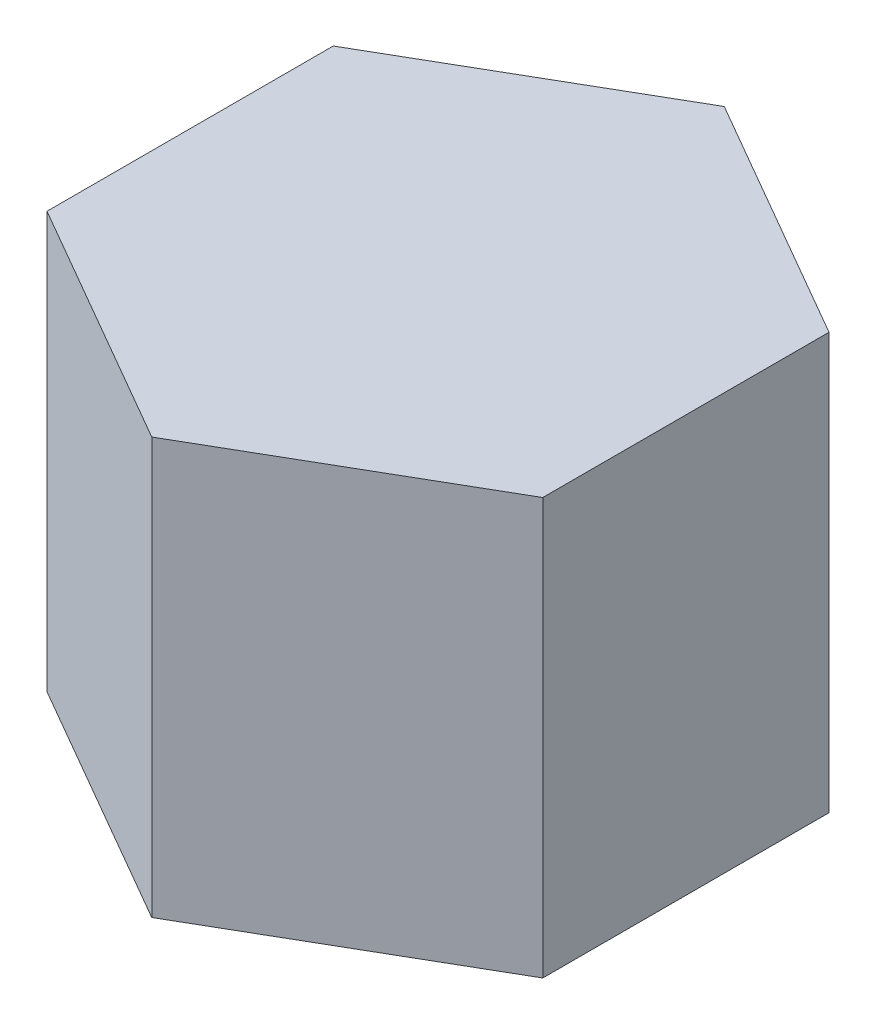
ISO-10303-21;
HEADER;
FILE_DESCRIPTION(('STEP AP214'),'2;1');
FILE_NAME('part.step','',(''),(''),'','','');
FILE_SCHEMA(('AUTOMOTIVE_DESIGN { 1 0 10303 214 1 1 1 1 }'));
ENDSEC;
DATA;
#1=APPLICATION_CONTEXT('core data for automotive mechanical design processes');
#2=APPLICATION_PROTOCOL_DEFINITION('international standard','automotive_design',2000,#1);
#3=PRODUCT_CONTEXT('',#1,'mechanical');
#4=PRODUCT('Part','Part','',(#3));
#5=PRODUCT_RELATED_PRODUCT_CATEGORY('part','',(#4));
#6=PRODUCT_DEFINITION_FORMATION('','',#4);
#7=PRODUCT_DEFINITION_CONTEXT('part definition',#1,'design');
#8=PRODUCT_DEFINITION('design','',#6,#7);
#9=PRODUCT_DEFINITION_SHAPE('','',#8);
#10=(LENGTH_UNIT() NAMED_UNIT(*) SI_UNIT(.MILLI.,.METRE.));
#11=(NAMED_UNIT(*) PLANE_ANGLE_UNIT() SI_UNIT($,.RADIAN.));
#12=(NAMED_UNIT(*) SI_UNIT($,.STERADIAN.) SOLID_ANGLE_UNIT());
#13=UNCERTAINTY_MEASURE_WITH_UNIT(LENGTH_MEASURE(1.E-05),#10,'distance_accuracy_value','');
#14=(GEOMETRIC_REPRESENTATION_CONTEXT(3) GLOBAL_UNCERTAINTY_ASSIGNED_CONTEXT((#13)) GLOBAL_UNIT_ASSIGNED_CONTEXT((#10,
#11,#12)) REPRESENTATION_CONTEXT('',''));
#15=CARTESIAN_POINT('',(0.,0.,0.));
#16=DIRECTION('',(0.,0.,1.));
#17=DIRECTION('',(1.,0.,0.));
#18=AXIS2_PLACEMENT_3D('',#15,#16,#17);
#19=CARTESIAN_POINT('',(209.339551417382,-147.556598747966,289.949920412926));
#20=DIRECTION('',(-0.499999999999978,0.,-0.866025403784452));
#21=DIRECTION('',(-0.866025403784452,0.,0.499999999999978));
#22=AXIS2_PLACEMENT_3D('',#19,#20,#21);
#23=PLANE('',#22);
#24=CARTESIAN_POINT('',(209.642660308706,-147.047793579175,289.774920412926));
#25=DIRECTION('',(-0.866025403784452,0.,0.499999999999978));
#26=VECTOR('',#25,1.);
#27=LINE('',#24,#26);
#28=CARTESIAN_POINT('',(209.642660308706,-147.047793579175,289.774920412926));
#29=VERTEX_POINT('',#28);
#30=CARTESIAN_POINT('',(209.339551417382,-147.047793579175,289.949920412926));
#31=VERTEX_POINT('',#30);
#32=EDGE_CURVE('E170',#29,#31,#27,.T.);
#33=ORIENTED_EDGE('',*,*,#32,.T.);
#34=CARTESIAN_POINT('',(209.339551417382,-147.556598747966,289.949920412926));
#35=DIRECTION('',(0.,1.,0.));
#36=VECTOR('',#35,1.);
#37=LINE('',#34,#36);
#38=CARTESIAN_POINT('',(209.339551417382,-147.556598747966,289.949920412926));
#39=VERTEX_POINT('',#38);
#40=EDGE_CURVE('E35',#39,#31,#37,.T.);
#41=ORIENTED_EDGE('',*,*,#40,.F.);
#42=CARTESIAN_POINT('',(209.642660308706,-147.556598747966,289.774920412926));
#43=DIRECTION('',(-0.866025403784452,0.,0.499999999999978));
#44=VECTOR('',#43,1.);
#45=LINE('',#42,#44);
#46=CARTESIAN_POINT('',(209.642660308706,-147.556598747966,289.774920412926));
#47=VERTEX_POINT('',#46);
#48=EDGE_CURVE('E159',#47,#39,#45,.T.);
#49=ORIENTED_EDGE('',*,*,#48,.F.);
#50=CARTESIAN_POINT('',(209.642660308706,-147.556598747966,289.774920412926));
#51=DIRECTION('',(0.,1.,0.));
#52=VECTOR('',#51,1.);
#53=LINE('',#50,#52);
#54=EDGE_CURVE('E10',#47,#29,#53,.T.);
#55=ORIENTED_EDGE('',*,*,#54,.T.);
#56=EDGE_LOOP('',(#33,#41,#49,#55));
#57=FACE_BOUND('',#56,.T.);
#58=ADVANCED_FACE('F16',(#57),#23,.F.);
#59=CARTESIAN_POINT('',(209.642660308706,-147.556598747966,291.594471220494));
#60=DIRECTION('',(-1.,0.,0.));
#61=DIRECTION('',(0.,-1.,0.));
#62=AXIS2_PLACEMENT_3D('',#59,#60,#61);
#63=PLANE('',#62);
#64=CARTESIAN_POINT('',(209.642660308706,-147.047793579175,289.424920412926));
#65=DIRECTION('',(0.,0.,1.));
#66=VECTOR('',#65,1.);
#67=LINE('',#64,#66);
#68=CARTESIAN_POINT('',(209.642660308706,-147.047793579175,289.424920412926));
#69=VERTEX_POINT('',#68);
#70=EDGE_CURVE('E167',#69,#29,#67,.T.);
#71=ORIENTED_EDGE('',*,*,#70,.T.);
#72=ORIENTED_EDGE('',*,*,#54,.F.);
#73=CARTESIAN_POINT('',(209.642660308706,-147.556598747966,289.424920412926));
#74=DIRECTION('',(0.,0.,1.));
#75=VECTOR('',#74,1.);
#76=LINE('',#73,#75);
#77=CARTESIAN_POINT('',(209.642660308706,-147.556598747966,289.424920412926));
#78=VERTEX_POINT('',#77);
#79=EDGE_CURVE('E156',#78,#47,#76,.T.);
#80=ORIENTED_EDGE('',*,*,#79,.F.);
#81=CARTESIAN_POINT('',(209.642660308706,-147.556598747966,289.424920412926));
#82=DIRECTION('',(0.,1.,0.));
#83=VECTOR('',#82,1.);
#84=LINE('',#81,#83);
#85=EDGE_CURVE('E27',#78,#69,#84,.T.);
#86=ORIENTED_EDGE('',*,*,#85,.T.);
#87=EDGE_LOOP('',(#71,#72,#80,#86));
#88=FACE_BOUND('',#87,.T.);
#89=ADVANCED_FACE('F189',(#88),#63,.F.);
#90=CARTESIAN_POINT('',(209.642660308706,-147.556598747966,289.424920412926));
#91=DIRECTION('',(-0.499999999999943,0.,0.866025403784471));
#92=DIRECTION('',(0.866025403784471,0.,0.499999999999943));
#93=AXIS2_PLACEMENT_3D('',#90,#91,#92);
#94=PLANE('',#93);
#95=CARTESIAN_POINT('',(209.339551417382,-147.047793579175,289.249920412926));
#96=DIRECTION('',(0.866025403784471,0.,0.499999999999943));
#97=VECTOR('',#96,1.);
#98=LINE('',#95,#97);
#99=CARTESIAN_POINT('',(209.339551417382,-147.047793579175,289.249920412926));
#100=VERTEX_POINT('',#99);
#101=EDGE_CURVE('E163',#100,#69,#98,.T.);
#102=ORIENTED_EDGE('',*,*,#101,.T.);
#103=ORIENTED_EDGE('',*,*,#85,.F.);
#104=CARTESIAN_POINT('',(209.339551417382,-147.556598747966,289.249920412926));
#105=DIRECTION('',(0.866025403784471,0.,0.499999999999943));
#106=VECTOR('',#105,1.);
#107=LINE('',#104,#106);
#108=CARTESIAN_POINT('',(209.339551417382,-147.556598747966,289.249920412926));
#109=VERTEX_POINT('',#108);
#110=EDGE_CURVE('E106',#109,#78,#107,.T.);
#111=ORIENTED_EDGE('',*,*,#110,.F.);
#112=CARTESIAN_POINT('',(209.339551417382,-147.556598747966,289.249920412926));
#113=DIRECTION('',(0.,1.,0.));
#114=VECTOR('',#113,1.);
#115=LINE('',#112,#114);
#116=EDGE_CURVE('E94',#109,#100,#115,.T.);
#117=ORIENTED_EDGE('',*,*,#116,.T.);
#118=EDGE_LOOP('',(#102,#103,#111,#117));
#119=FACE_BOUND('',#118,.T.);
#120=ADVANCED_FACE('F198',(#119),#94,.F.);
#121=CARTESIAN_POINT('',(209.339551417382,-147.556598747966,289.249920412926));
#122=DIRECTION('',(0.499999999999978,0.,0.866025403784452));
#123=DIRECTION('',(0.866025403784452,0.,-0.499999999999978));
#124=AXIS2_PLACEMENT_3D('',#121,#122,#123);
#125=PLANE('',#124);
#126=CARTESIAN_POINT('',(209.036442526057,-147.047793579175,289.424920412926));
#127=DIRECTION('',(0.866025403784452,0.,-0.499999999999978));
#128=VECTOR('',#127,1.);
#129=LINE('',#126,#128);
#130=CARTESIAN_POINT('',(209.036442526057,-147.047793579175,289.424920412926));
#131=VERTEX_POINT('',#130);
#132=EDGE_CURVE('E162',#131,#100,#129,.T.);
#133=ORIENTED_EDGE('',*,*,#132,.T.);
#134=ORIENTED_EDGE('',*,*,#116,.F.);
#135=CARTESIAN_POINT('',(209.036442526057,-147.556598747966,289.424920412926));
#136=DIRECTION('',(0.866025403784452,0.,-0.499999999999978));
#137=VECTOR('',#136,1.);
#138=LINE('',#135,#137);
#139=CARTESIAN_POINT('',(209.036442526057,-147.556598747966,289.424920412926));
#140=VERTEX_POINT('',#139);
#141=EDGE_CURVE('E98',#140,#109,#138,.T.);
#142=ORIENTED_EDGE('',*,*,#141,.F.);
#143=CARTESIAN_POINT('',(209.036442526057,-147.556598747966,289.424920412926));
#144=DIRECTION('',(0.,1.,0.));
#145=VECTOR('',#144,1.);
#146=LINE('',#143,#145);
#147=EDGE_CURVE('E79',#140,#131,#146,.T.);
#148=ORIENTED_EDGE('',*,*,#147,.T.);
#149=EDGE_LOOP('',(#133,#134,#142,#148));
#150=FACE_BOUND('',#149,.T.);
#151=ADVANCED_FACE('F100',(#150),#125,.F.);
#152=CARTESIAN_POINT('',(209.036442526057,-147.556598747966,291.594471220494));
#153=DIRECTION('',(1.,0.,0.));
#154=DIRECTION('',(0.,1.,0.));
#155=AXIS2_PLACEMENT_3D('',#152,#153,#154);
#156=PLANE('',#155);
#157=CARTESIAN_POINT('',(209.036442526057,-147.047793579175,289.774920412926));
#158=DIRECTION('',(0.,0.,-1.));
#159=VECTOR('',#158,1.);
#160=LINE('',#157,#159);
#161=CARTESIAN_POINT('',(209.036442526057,-147.047793579175,289.774920412926));
#162=VERTEX_POINT('',#161);
#163=EDGE_CURVE('E88',#162,#131,#160,.T.);
#164=ORIENTED_EDGE('',*,*,#163,.T.);
#165=ORIENTED_EDGE('',*,*,#147,.F.);
#166=CARTESIAN_POINT('',(209.036442526057,-147.556598747966,289.774920412926));
#167=DIRECTION('',(0.,0.,-1.));
#168=VECTOR('',#167,1.);
#169=LINE('',#166,#168);
#170=CARTESIAN_POINT('',(209.036442526057,-147.556598747966,289.774920412926));
#171=VERTEX_POINT('',#170);
#172=EDGE_CURVE('E84',#171,#140,#169,.T.);
#173=ORIENTED_EDGE('',*,*,#172,.F.);
#174=CARTESIAN_POINT('',(209.036442526057,-147.556598747966,289.774920412926));
#175=DIRECTION('',(0.,1.,0.));
#176=VECTOR('',#175,1.);
#177=LINE('',#174,#176);
#178=EDGE_CURVE('E58',#171,#162,#177,.T.);
#179=ORIENTED_EDGE('',*,*,#178,.T.);
#180=EDGE_LOOP('',(#164,#165,#173,#179));
#181=FACE_BOUND('',#180,.T.);
#182=ADVANCED_FACE('F82',(#181),#156,.F.);
#183=CARTESIAN_POINT('',(209.036442526057,-147.556598747966,289.774920412926));
#184=DIRECTION('',(0.499999999999943,0.,-0.866025403784471));
#185=DIRECTION('',(-0.866025403784471,0.,-0.499999999999943));
#186=AXIS2_PLACEMENT_3D('',#183,#184,#185);
#187=PLANE('',#186);
#188=CARTESIAN_POINT('',(209.339551417382,-147.047793579175,289.949920412926));
#189=DIRECTION('',(-0.866025403784471,0.,-0.499999999999943));
#190=VECTOR('',#189,1.);
#191=LINE('',#188,#190);
#192=EDGE_CURVE('E160',#31,#162,#191,.T.);
#193=ORIENTED_EDGE('',*,*,#192,.T.);
#194=ORIENTED_EDGE('',*,*,#178,.F.);
#195=CARTESIAN_POINT('',(209.339551417382,-147.556598747966,289.949920412926));
#196=DIRECTION('',(-0.866025403784471,0.,-0.499999999999943));
#197=VECTOR('',#196,1.);
#198=LINE('',#195,#197);
#199=EDGE_CURVE('E112',#39,#171,#198,.T.);
#200=ORIENTED_EDGE('',*,*,#199,.F.);
#201=ORIENTED_EDGE('',*,*,#40,.T.);
#202=EDGE_LOOP('',(#193,#194,#200,#201));
#203=FACE_BOUND('',#202,.T.);
#204=ADVANCED_FACE('F131',(#203),#187,.F.);
#205=CARTESIAN_POINT('',(206.491105863044,-147.556598747966,291.594471220494));
#206=DIRECTION('',(0.,1.,0.));
#207=DIRECTION('',(-1.,0.,0.));
#208=AXIS2_PLACEMENT_3D('',#205,#206,#207);
#209=PLANE('',#208);
#210=ORIENTED_EDGE('',*,*,#48,.T.);
#211=ORIENTED_EDGE('',*,*,#199,.T.);
#212=ORIENTED_EDGE('',*,*,#172,.T.);
#213=ORIENTED_EDGE('',*,*,#141,.T.);
#214=ORIENTED_EDGE('',*,*,#110,.T.);
#215=ORIENTED_EDGE('',*,*,#79,.T.);
#216=EDGE_LOOP('',(#210,#211,#212,#213,#214,#215));
#217=FACE_BOUND('',#216,.T.);
#218=ADVANCED_FACE('F111',(#217),#209,.F.);
#219=CARTESIAN_POINT('',(206.491105863044,-147.047793579175,291.594471220494));
#220=DIRECTION('',(0.,1.,0.));
#221=DIRECTION('',(-1.,0.,0.));
#222=AXIS2_PLACEMENT_3D('',#219,#220,#221);
#223=PLANE('',#222);
#224=ORIENTED_EDGE('',*,*,#32,.F.);
#225=ORIENTED_EDGE('',*,*,#70,.F.);
#226=ORIENTED_EDGE('',*,*,#101,.F.);
#227=ORIENTED_EDGE('',*,*,#132,.F.);
#228=ORIENTED_EDGE('',*,*,#163,.F.);
#229=ORIENTED_EDGE('',*,*,#192,.F.);
#230=EDGE_LOOP('',(#224,#225,#226,#227,#228,#229));
#231=FACE_BOUND('',#230,.T.);
#232=ADVANCED_FACE('F130',(#231),#223,.T.);
#233=CLOSED_SHELL('',(#58,#89,#120,#151,#182,#204,#218,#232));
#234=MANIFOLD_SOLID_BREP('B1',#233);
#235=ADVANCED_BREP_SHAPE_REPRESENTATION('',(#18,#234),#14);
#236=SHAPE_DEFINITION_REPRESENTATION(#9,#235);
ENDSEC;
END-ISO-10303-21;
